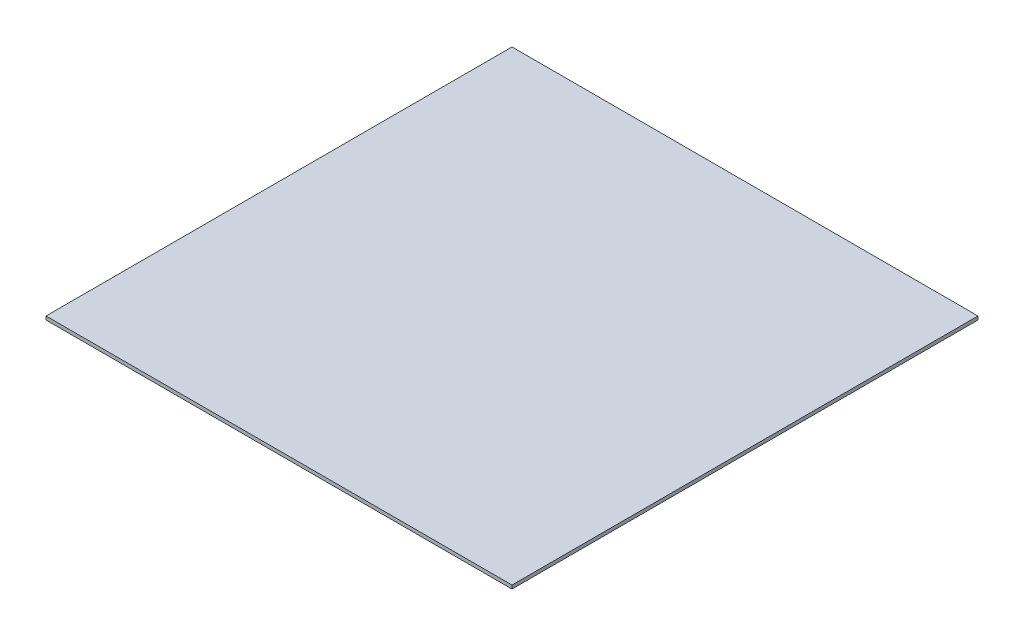
ISO-10303-21;
HEADER;
FILE_DESCRIPTION(('STEP AP214'),'2;1');
FILE_NAME('part.step','',(''),(''),'','','');
FILE_SCHEMA(('AUTOMOTIVE_DESIGN { 1 0 10303 214 1 1 1 1 }'));
ENDSEC;
DATA;
#1=APPLICATION_CONTEXT('core data for automotive mechanical design processes');
#2=APPLICATION_PROTOCOL_DEFINITION('international standard','automotive_design',2000,#1);
#3=PRODUCT_CONTEXT('',#1,'mechanical');
#4=PRODUCT('Part','Part','',(#3));
#5=PRODUCT_RELATED_PRODUCT_CATEGORY('part','',(#4));
#6=PRODUCT_DEFINITION_FORMATION('','',#4);
#7=PRODUCT_DEFINITION_CONTEXT('part definition',#1,'design');
#8=PRODUCT_DEFINITION('design','',#6,#7);
#9=PRODUCT_DEFINITION_SHAPE('','',#8);
#10=(LENGTH_UNIT() NAMED_UNIT(*) SI_UNIT(.MILLI.,.METRE.));
#11=(NAMED_UNIT(*) PLANE_ANGLE_UNIT() SI_UNIT($,.RADIAN.));
#12=(NAMED_UNIT(*) SI_UNIT($,.STERADIAN.) SOLID_ANGLE_UNIT());
#13=UNCERTAINTY_MEASURE_WITH_UNIT(LENGTH_MEASURE(1.E-05),#10,'distance_accuracy_value','');
#14=(GEOMETRIC_REPRESENTATION_CONTEXT(3) GLOBAL_UNCERTAINTY_ASSIGNED_CONTEXT((#13)) GLOBAL_UNIT_ASSIGNED_CONTEXT((#10,
#11,#12)) REPRESENTATION_CONTEXT('',''));
#15=CARTESIAN_POINT('',(0.,0.,0.));
#16=DIRECTION('',(0.,0.,1.));
#17=DIRECTION('',(1.,0.,0.));
#18=AXIS2_PLACEMENT_3D('',#15,#16,#17);
#19=CARTESIAN_POINT('',(200.,3.,-200.));
#20=DIRECTION('',(-1.,0.,0.));
#21=DIRECTION('',(0.,0.,1.));
#22=AXIS2_PLACEMENT_3D('',#19,#20,#21);
#23=PLANE('',#22);
#24=DIRECTION('',(0.,0.,-1.));
#25=VECTOR('',#24,1.);
#26=CARTESIAN_POINT('',(200.,0.,-200.));
#27=LINE('',#26,#25);
#28=CARTESIAN_POINT('',(200.,0.,200.));
#29=VERTEX_POINT('',#28);
#30=CARTESIAN_POINT('',(200.,0.,-200.));
#31=VERTEX_POINT('',#30);
#32=EDGE_CURVE('E96',#29,#31,#27,.T.);
#33=ORIENTED_EDGE('',*,*,#32,.T.);
#34=DIRECTION('',(0.,-1.,0.));
#35=VECTOR('',#34,1.);
#36=CARTESIAN_POINT('',(200.,3.,-200.));
#37=LINE('',#36,#35);
#38=CARTESIAN_POINT('',(200.,3.,-200.));
#39=VERTEX_POINT('',#38);
#40=EDGE_CURVE('E11',#39,#31,#37,.T.);
#41=ORIENTED_EDGE('',*,*,#40,.F.);
#42=DIRECTION('',(0.,0.,-1.));
#43=VECTOR('',#42,1.);
#44=CARTESIAN_POINT('',(200.,3.,-200.));
#45=LINE('',#44,#43);
#46=CARTESIAN_POINT('',(200.,3.,200.));
#47=VERTEX_POINT('',#46);
#48=EDGE_CURVE('E84',#47,#39,#45,.T.);
#49=ORIENTED_EDGE('',*,*,#48,.F.);
#50=DIRECTION('',(0.,-1.,0.));
#51=VECTOR('',#50,1.);
#52=CARTESIAN_POINT('',(200.,3.,200.));
#53=LINE('',#52,#51);
#54=EDGE_CURVE('E92',#47,#29,#53,.T.);
#55=ORIENTED_EDGE('',*,*,#54,.T.);
#56=EDGE_LOOP('',(#33,#41,#49,#55));
#57=FACE_BOUND('',#56,.T.);
#58=ADVANCED_FACE('F33',(#57),#23,.F.);
#59=CARTESIAN_POINT('',(-200.,3.,-200.));
#60=DIRECTION('',(0.,0.,1.));
#61=DIRECTION('',(1.,0.,0.));
#62=AXIS2_PLACEMENT_3D('',#59,#60,#61);
#63=PLANE('',#62);
#64=DIRECTION('',(-1.,0.,0.));
#65=VECTOR('',#64,1.);
#66=CARTESIAN_POINT('',(-200.,0.,-200.));
#67=LINE('',#66,#65);
#68=CARTESIAN_POINT('',(-200.,0.,-200.));
#69=VERTEX_POINT('',#68);
#70=EDGE_CURVE('E88',#31,#69,#67,.T.);
#71=ORIENTED_EDGE('',*,*,#70,.T.);
#72=DIRECTION('',(0.,-1.,0.));
#73=VECTOR('',#72,1.);
#74=CARTESIAN_POINT('',(-200.,3.,-200.));
#75=LINE('',#74,#73);
#76=CARTESIAN_POINT('',(-200.,3.,-200.));
#77=VERTEX_POINT('',#76);
#78=EDGE_CURVE('E41',#77,#69,#75,.T.);
#79=ORIENTED_EDGE('',*,*,#78,.F.);
#80=DIRECTION('',(-1.,0.,0.));
#81=VECTOR('',#80,1.);
#82=CARTESIAN_POINT('',(-200.,3.,-200.));
#83=LINE('',#82,#81);
#84=EDGE_CURVE('E79',#39,#77,#83,.T.);
#85=ORIENTED_EDGE('',*,*,#84,.F.);
#86=ORIENTED_EDGE('',*,*,#40,.T.);
#87=EDGE_LOOP('',(#71,#79,#85,#86));
#88=FACE_BOUND('',#87,.T.);
#89=ADVANCED_FACE('F87',(#88),#63,.F.);
#90=CARTESIAN_POINT('',(-200.,3.,-200.));
#91=DIRECTION('',(1.,0.,0.));
#92=DIRECTION('',(0.,0.,-1.));
#93=AXIS2_PLACEMENT_3D('',#90,#91,#92);
#94=PLANE('',#93);
#95=DIRECTION('',(0.,0.,1.));
#96=VECTOR('',#95,1.);
#97=CARTESIAN_POINT('',(-200.,0.,-200.));
#98=LINE('',#97,#96);
#99=CARTESIAN_POINT('',(-200.,0.,200.));
#100=VERTEX_POINT('',#99);
#101=EDGE_CURVE('E66',#69,#100,#98,.T.);
#102=ORIENTED_EDGE('',*,*,#101,.T.);
#103=DIRECTION('',(0.,-1.,0.));
#104=VECTOR('',#103,1.);
#105=CARTESIAN_POINT('',(-200.,3.,200.));
#106=LINE('',#105,#104);
#107=CARTESIAN_POINT('',(-200.,3.,200.));
#108=VERTEX_POINT('',#107);
#109=EDGE_CURVE('E89',#108,#100,#106,.T.);
#110=ORIENTED_EDGE('',*,*,#109,.F.);
#111=DIRECTION('',(0.,0.,1.));
#112=VECTOR('',#111,1.);
#113=CARTESIAN_POINT('',(-200.,3.,-200.));
#114=LINE('',#113,#112);
#115=EDGE_CURVE('E82',#77,#108,#114,.T.);
#116=ORIENTED_EDGE('',*,*,#115,.F.);
#117=ORIENTED_EDGE('',*,*,#78,.T.);
#118=EDGE_LOOP('',(#102,#110,#116,#117));
#119=FACE_BOUND('',#118,.T.);
#120=ADVANCED_FACE('F90',(#119),#94,.F.);
#121=CARTESIAN_POINT('',(-200.,3.,200.));
#122=DIRECTION('',(0.,0.,-1.));
#123=DIRECTION('',(-1.,0.,0.));
#124=AXIS2_PLACEMENT_3D('',#121,#122,#123);
#125=PLANE('',#124);
#126=DIRECTION('',(1.,0.,0.));
#127=VECTOR('',#126,1.);
#128=CARTESIAN_POINT('',(-200.,0.,200.));
#129=LINE('',#128,#127);
#130=EDGE_CURVE('E72',#100,#29,#129,.T.);
#131=ORIENTED_EDGE('',*,*,#130,.T.);
#132=ORIENTED_EDGE('',*,*,#54,.F.);
#133=DIRECTION('',(1.,0.,0.));
#134=VECTOR('',#133,1.);
#135=CARTESIAN_POINT('',(-200.,3.,200.));
#136=LINE('',#135,#134);
#137=EDGE_CURVE('E49',#108,#47,#136,.T.);
#138=ORIENTED_EDGE('',*,*,#137,.F.);
#139=ORIENTED_EDGE('',*,*,#109,.T.);
#140=EDGE_LOOP('',(#131,#132,#138,#139));
#141=FACE_BOUND('',#140,.T.);
#142=ADVANCED_FACE('F103',(#141),#125,.F.);
#143=CARTESIAN_POINT('',(0.,3.,0.));
#144=DIRECTION('',(0.,1.,0.));
#145=DIRECTION('',(0.,0.,1.));
#146=AXIS2_PLACEMENT_3D('',#143,#144,#145);
#147=PLANE('',#146);
#148=ORIENTED_EDGE('',*,*,#48,.T.);
#149=ORIENTED_EDGE('',*,*,#84,.T.);
#150=ORIENTED_EDGE('',*,*,#115,.T.);
#151=ORIENTED_EDGE('',*,*,#137,.T.);
#152=EDGE_LOOP('',(#148,#149,#150,#151));
#153=FACE_BOUND('',#152,.T.);
#154=ADVANCED_FACE('F80',(#153),#147,.T.);
#155=CARTESIAN_POINT('',(0.,0.,0.));
#156=DIRECTION('',(0.,1.,0.));
#157=DIRECTION('',(0.,0.,1.));
#158=AXIS2_PLACEMENT_3D('',#155,#156,#157);
#159=PLANE('',#158);
#160=ORIENTED_EDGE('',*,*,#32,.F.);
#161=ORIENTED_EDGE('',*,*,#130,.F.);
#162=ORIENTED_EDGE('',*,*,#101,.F.);
#163=ORIENTED_EDGE('',*,*,#70,.F.);
#164=EDGE_LOOP('',(#160,#161,#162,#163));
#165=FACE_BOUND('',#164,.T.);
#166=ADVANCED_FACE('F106',(#165),#159,.F.);
#167=CLOSED_SHELL('',(#58,#89,#120,#142,#154,#166));
#168=MANIFOLD_SOLID_BREP('B2',#167);
#169=ADVANCED_BREP_SHAPE_REPRESENTATION('',(#18,#168),#14);
#170=SHAPE_DEFINITION_REPRESENTATION(#9,#169);
ENDSEC;
END-ISO-10303-21;
